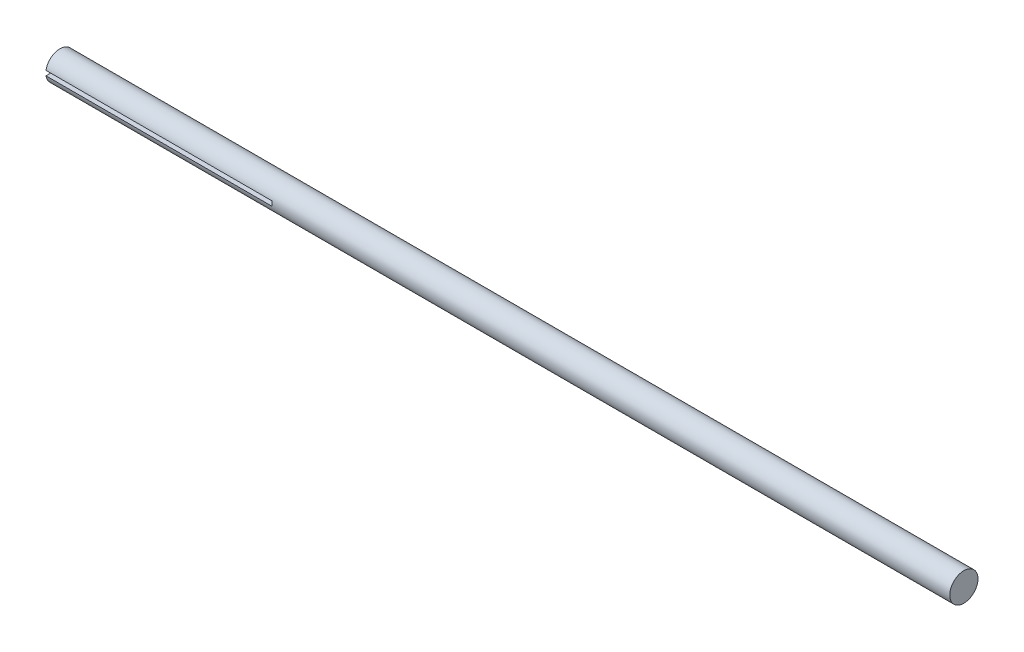
ISO-10303-21;
HEADER;
FILE_DESCRIPTION(('STEP AP214'),'2;1');
FILE_NAME('part.step','',(''),(''),'','','');
FILE_SCHEMA(('AUTOMOTIVE_DESIGN { 1 0 10303 214 1 1 1 1 }'));
ENDSEC;
DATA;
#1=APPLICATION_CONTEXT('core data for automotive mechanical design processes');
#2=APPLICATION_PROTOCOL_DEFINITION('international standard','automotive_design',2000,#1);
#3=PRODUCT_CONTEXT('',#1,'mechanical');
#4=PRODUCT('Part','Part','',(#3));
#5=PRODUCT_RELATED_PRODUCT_CATEGORY('part','',(#4));
#6=PRODUCT_DEFINITION_FORMATION('','',#4);
#7=PRODUCT_DEFINITION_CONTEXT('part definition',#1,'design');
#8=PRODUCT_DEFINITION('design','',#6,#7);
#9=PRODUCT_DEFINITION_SHAPE('','',#8);
#10=(LENGTH_UNIT() NAMED_UNIT(*) SI_UNIT(.MILLI.,.METRE.));
#11=(NAMED_UNIT(*) PLANE_ANGLE_UNIT() SI_UNIT($,.RADIAN.));
#12=(NAMED_UNIT(*) SI_UNIT($,.STERADIAN.) SOLID_ANGLE_UNIT());
#13=UNCERTAINTY_MEASURE_WITH_UNIT(LENGTH_MEASURE(1.E-05),#10,'distance_accuracy_value','');
#14=(GEOMETRIC_REPRESENTATION_CONTEXT(3) GLOBAL_UNCERTAINTY_ASSIGNED_CONTEXT((#13)) GLOBAL_UNIT_ASSIGNED_CONTEXT((#10,
#11,#12)) REPRESENTATION_CONTEXT('',''));
#15=CARTESIAN_POINT('',(0.,0.,0.));
#16=DIRECTION('',(0.,0.,1.));
#17=DIRECTION('',(1.,0.,0.));
#18=AXIS2_PLACEMENT_3D('',#15,#16,#17);
#19=CARTESIAN_POINT('',(0.,0.,0.));
#20=DIRECTION('',(1.,0.,0.));
#21=DIRECTION('',(0.,0.,-1.));
#22=AXIS2_PLACEMENT_3D('',#19,#20,#21);
#23=PLANE('',#22);
#24=CARTESIAN_POINT('',(0.,0.,0.));
#25=DIRECTION('',(1.,0.,0.));
#26=DIRECTION('',(0.,0.,-1.));
#27=AXIS2_PLACEMENT_3D('',#24,#25,#26);
#28=CIRCLE('',#27,4.7625);
#29=CARTESIAN_POINT('',(0.,0.793749999999999,-4.69588832783532));
#30=VERTEX_POINT('',#29);
#31=CARTESIAN_POINT('',(0.,0.79375,4.69588832783532));
#32=VERTEX_POINT('',#31);
#33=EDGE_CURVE('E92',#30,#32,#28,.T.);
#34=ORIENTED_EDGE('',*,*,#33,.F.);
#35=DIRECTION('',(0.,0.,1.));
#36=VECTOR('',#35,1.);
#37=CARTESIAN_POINT('',(0.,0.79375,0.));
#38=LINE('',#37,#36);
#39=EDGE_CURVE('E81',#30,#32,#38,.T.);
#40=ORIENTED_EDGE('',*,*,#39,.T.);
#41=EDGE_LOOP('',(#34,#40));
#42=FACE_BOUND('',#41,.T.);
#43=ADVANCED_FACE('F33',(#42),#23,.F.);
#44=CARTESIAN_POINT('',(304.8,0.,0.));
#45=DIRECTION('',(-1.,0.,0.));
#46=DIRECTION('',(0.,0.,1.));
#47=AXIS2_PLACEMENT_3D('',#44,#45,#46);
#48=CYLINDRICAL_SURFACE('',#47,4.7625);
#49=ORIENTED_EDGE('',*,*,#33,.T.);
#50=DIRECTION('',(-1.,0.,0.));
#51=VECTOR('',#50,1.);
#52=CARTESIAN_POINT('',(304.8,0.79375,4.69588832783532));
#53=LINE('',#52,#51);
#54=CARTESIAN_POINT('',(76.2,0.79375,4.69588832783532));
#55=VERTEX_POINT('',#54);
#56=EDGE_CURVE('E89',#32,#55,#53,.F.);
#57=ORIENTED_EDGE('',*,*,#56,.T.);
#58=CARTESIAN_POINT('',(76.2,0.,0.));
#59=DIRECTION('',(1.,0.,0.));
#60=DIRECTION('',(0.,0.,-1.));
#61=AXIS2_PLACEMENT_3D('',#58,#59,#60);
#62=CIRCLE('',#61,4.7625);
#63=CARTESIAN_POINT('',(76.2,-0.79375,4.69588832783532));
#64=VERTEX_POINT('',#63);
#65=EDGE_CURVE('E11',#55,#64,#62,.T.);
#66=ORIENTED_EDGE('',*,*,#65,.T.);
#67=DIRECTION('',(-1.,0.,0.));
#68=VECTOR('',#67,1.);
#69=CARTESIAN_POINT('',(304.8,-0.793749999999999,4.69588832783532));
#70=LINE('',#69,#68);
#71=CARTESIAN_POINT('',(0.,-0.79375,4.69588832783532));
#72=VERTEX_POINT('',#71);
#73=EDGE_CURVE('E76',#64,#72,#70,.T.);
#74=ORIENTED_EDGE('',*,*,#73,.T.);
#75=CARTESIAN_POINT('',(0.,-0.793750000000001,-4.69588832783532));
#76=VERTEX_POINT('',#75);
#77=EDGE_CURVE('E87',#72,#76,#28,.T.);
#78=ORIENTED_EDGE('',*,*,#77,.T.);
#79=DIRECTION('',(-1.,0.,0.));
#80=VECTOR('',#79,1.);
#81=CARTESIAN_POINT('',(304.8,-0.79375,-4.69588832783532));
#82=LINE('',#81,#80);
#83=CARTESIAN_POINT('',(76.2,-0.793750000000001,-4.69588832783532));
#84=VERTEX_POINT('',#83);
#85=EDGE_CURVE('E48',#76,#84,#82,.F.);
#86=ORIENTED_EDGE('',*,*,#85,.T.);
#87=CARTESIAN_POINT('',(76.2,0.793749999999999,-4.69588832783532));
#88=VERTEX_POINT('',#87);
#89=EDGE_CURVE('E37',#84,#88,#62,.T.);
#90=ORIENTED_EDGE('',*,*,#89,.T.);
#91=DIRECTION('',(-1.,0.,0.));
#92=VECTOR('',#91,1.);
#93=CARTESIAN_POINT('',(304.8,0.793749999999999,-4.69588832783532));
#94=LINE('',#93,#92);
#95=EDGE_CURVE('E56',#88,#30,#94,.T.);
#96=ORIENTED_EDGE('',*,*,#95,.T.);
#97=EDGE_LOOP('',(#49,#57,#66,#74,#78,#86,#90,#96));
#98=FACE_BOUND('',#97,.T.);
#99=CARTESIAN_POINT('',(304.8,0.,0.));
#100=DIRECTION('',(1.,0.,0.));
#101=DIRECTION('',(0.,0.,-1.));
#102=AXIS2_PLACEMENT_3D('',#99,#100,#101);
#103=CIRCLE('',#102,4.7625);
#104=CARTESIAN_POINT('',(304.8,0.,-4.7625));
#105=VERTEX_POINT('',#104);
#106=EDGE_CURVE('E82',#105,#105,#103,.T.);
#107=ORIENTED_EDGE('',*,*,#106,.F.);
#108=EDGE_LOOP('',(#107));
#109=FACE_BOUND('',#108,.T.);
#110=ADVANCED_FACE('F35',(#98,#109),#48,.T.);
#111=CARTESIAN_POINT('',(304.8,0.,0.));
#112=DIRECTION('',(1.,0.,0.));
#113=DIRECTION('',(0.,0.,-1.));
#114=AXIS2_PLACEMENT_3D('',#111,#112,#113);
#115=PLANE('',#114);
#116=ORIENTED_EDGE('',*,*,#106,.T.);
#117=EDGE_LOOP('',(#116));
#118=FACE_BOUND('',#117,.T.);
#119=ADVANCED_FACE('F121',(#118),#115,.T.);
#120=ORIENTED_EDGE('',*,*,#77,.F.);
#121=DIRECTION('',(0.,0.,-1.));
#122=VECTOR('',#121,1.);
#123=CARTESIAN_POINT('',(0.,-0.79375,0.));
#124=LINE('',#123,#122);
#125=EDGE_CURVE('E73',#72,#76,#124,.T.);
#126=ORIENTED_EDGE('',*,*,#125,.T.);
#127=EDGE_LOOP('',(#120,#126));
#128=FACE_BOUND('',#127,.T.);
#129=ADVANCED_FACE('F91',(#128),#23,.F.);
#130=CARTESIAN_POINT('',(76.2,0.,0.));
#131=DIRECTION('',(1.,0.,0.));
#132=DIRECTION('',(0.,0.,-1.));
#133=AXIS2_PLACEMENT_3D('',#130,#131,#132);
#134=PLANE('',#133);
#135=DIRECTION('',(0.,0.,-1.));
#136=VECTOR('',#135,1.);
#137=CARTESIAN_POINT('',(76.2,0.793750000000001,6.35));
#138=LINE('',#137,#136);
#139=EDGE_CURVE('E103',#55,#88,#138,.T.);
#140=ORIENTED_EDGE('',*,*,#139,.T.);
#141=ORIENTED_EDGE('',*,*,#89,.F.);
#142=DIRECTION('',(0.,0.,1.));
#143=VECTOR('',#142,1.);
#144=CARTESIAN_POINT('',(76.2,-0.793749999999999,6.35));
#145=LINE('',#144,#143);
#146=EDGE_CURVE('E102',#84,#64,#145,.T.);
#147=ORIENTED_EDGE('',*,*,#146,.T.);
#148=ORIENTED_EDGE('',*,*,#65,.F.);
#149=EDGE_LOOP('',(#140,#141,#147,#148));
#150=FACE_BOUND('',#149,.T.);
#151=ADVANCED_FACE('F101',(#150),#134,.F.);
#152=CARTESIAN_POINT('',(76.2,0.793750000000001,6.35));
#153=DIRECTION('',(0.,1.,0.));
#154=DIRECTION('',(0.,0.,1.));
#155=AXIS2_PLACEMENT_3D('',#152,#153,#154);
#156=PLANE('',#155);
#157=ORIENTED_EDGE('',*,*,#139,.F.);
#158=ORIENTED_EDGE('',*,*,#56,.F.);
#159=ORIENTED_EDGE('',*,*,#39,.F.);
#160=ORIENTED_EDGE('',*,*,#95,.F.);
#161=EDGE_LOOP('',(#157,#158,#159,#160));
#162=FACE_BOUND('',#161,.T.);
#163=ADVANCED_FACE('F108',(#162),#156,.F.);
#164=CARTESIAN_POINT('',(76.2,-0.793749999999999,6.35));
#165=DIRECTION('',(0.,-1.,0.));
#166=DIRECTION('',(0.,0.,-1.));
#167=AXIS2_PLACEMENT_3D('',#164,#165,#166);
#168=PLANE('',#167);
#169=ORIENTED_EDGE('',*,*,#146,.F.);
#170=ORIENTED_EDGE('',*,*,#85,.F.);
#171=ORIENTED_EDGE('',*,*,#125,.F.);
#172=ORIENTED_EDGE('',*,*,#73,.F.);
#173=EDGE_LOOP('',(#169,#170,#171,#172));
#174=FACE_BOUND('',#173,.T.);
#175=ADVANCED_FACE('F75',(#174),#168,.F.);
#176=CLOSED_SHELL('',(#43,#110,#119,#129,#151,#163,#175));
#177=MANIFOLD_SOLID_BREP('B2',#176);
#178=ADVANCED_BREP_SHAPE_REPRESENTATION('',(#18,#177),#14);
#179=SHAPE_DEFINITION_REPRESENTATION(#9,#178);
ENDSEC;
END-ISO-10303-21;
